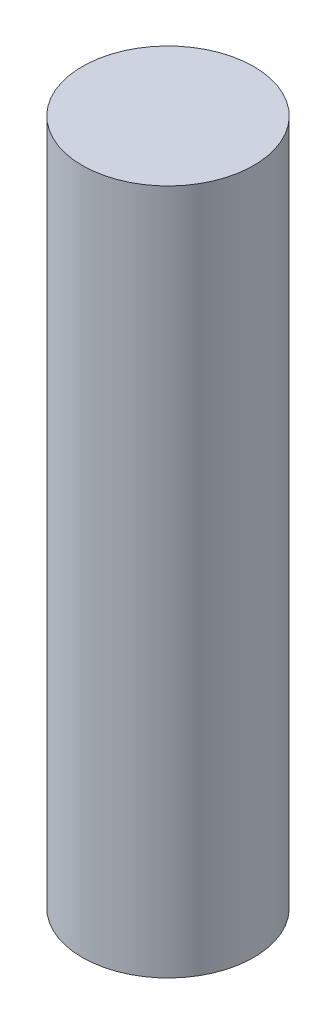
ISO-10303-21;
HEADER;
FILE_DESCRIPTION(('STEP AP214'),'2;1');
FILE_NAME('part.step','',(''),(''),'','','');
FILE_SCHEMA(('AUTOMOTIVE_DESIGN { 1 0 10303 214 1 1 1 1 }'));
ENDSEC;
DATA;
#1=APPLICATION_CONTEXT('core data for automotive mechanical design processes');
#2=APPLICATION_PROTOCOL_DEFINITION('international standard','automotive_design',2000,#1);
#3=PRODUCT_CONTEXT('',#1,'mechanical');
#4=PRODUCT('Part','Part','',(#3));
#5=PRODUCT_RELATED_PRODUCT_CATEGORY('part','',(#4));
#6=PRODUCT_DEFINITION_FORMATION('','',#4);
#7=PRODUCT_DEFINITION_CONTEXT('part definition',#1,'design');
#8=PRODUCT_DEFINITION('design','',#6,#7);
#9=PRODUCT_DEFINITION_SHAPE('','',#8);
#10=(LENGTH_UNIT() NAMED_UNIT(*) SI_UNIT(.MILLI.,.METRE.));
#11=(NAMED_UNIT(*) PLANE_ANGLE_UNIT() SI_UNIT($,.RADIAN.));
#12=(NAMED_UNIT(*) SI_UNIT($,.STERADIAN.) SOLID_ANGLE_UNIT());
#13=UNCERTAINTY_MEASURE_WITH_UNIT(LENGTH_MEASURE(1.E-05),#10,'distance_accuracy_value','');
#14=(GEOMETRIC_REPRESENTATION_CONTEXT(3) GLOBAL_UNCERTAINTY_ASSIGNED_CONTEXT((#13)) GLOBAL_UNIT_ASSIGNED_CONTEXT((#10,
#11,#12)) REPRESENTATION_CONTEXT('',''));
#15=CARTESIAN_POINT('',(0.,0.,0.));
#16=DIRECTION('',(0.,0.,1.));
#17=DIRECTION('',(1.,0.,0.));
#18=AXIS2_PLACEMENT_3D('',#15,#16,#17);
#19=CARTESIAN_POINT('',(0.,100.,0.));
#20=DIRECTION('',(0.,-1.,0.));
#21=DIRECTION('',(0.,0.,-1.));
#22=AXIS2_PLACEMENT_3D('',#19,#20,#21);
#23=CYLINDRICAL_SURFACE('',#22,25.);
#24=CARTESIAN_POINT('',(0.,100.,0.));
#25=DIRECTION('',(0.,1.,0.));
#26=DIRECTION('',(0.,0.,1.));
#27=AXIS2_PLACEMENT_3D('',#24,#25,#26);
#28=CIRCLE('',#27,25.);
#29=CARTESIAN_POINT('',(0.,100.,25.));
#30=VERTEX_POINT('',#29);
#31=EDGE_CURVE('E10',#30,#30,#28,.T.);
#32=ORIENTED_EDGE('',*,*,#31,.F.);
#33=EDGE_LOOP('',(#32));
#34=FACE_BOUND('',#33,.T.);
#35=CARTESIAN_POINT('',(0.,-100.,0.));
#36=DIRECTION('',(0.,1.,0.));
#37=DIRECTION('',(0.,0.,1.));
#38=AXIS2_PLACEMENT_3D('',#35,#36,#37);
#39=CIRCLE('',#38,25.);
#40=CARTESIAN_POINT('',(0.,-100.,25.));
#41=VERTEX_POINT('',#40);
#42=EDGE_CURVE('E34',#41,#41,#39,.T.);
#43=ORIENTED_EDGE('',*,*,#42,.T.);
#44=EDGE_LOOP('',(#43));
#45=FACE_BOUND('',#44,.T.);
#46=ADVANCED_FACE('F31',(#34,#45),#23,.T.);
#47=CARTESIAN_POINT('',(0.,100.,0.));
#48=DIRECTION('',(0.,1.,0.));
#49=DIRECTION('',(0.,0.,1.));
#50=AXIS2_PLACEMENT_3D('',#47,#48,#49);
#51=PLANE('',#50);
#52=ORIENTED_EDGE('',*,*,#31,.T.);
#53=EDGE_LOOP('',(#52));
#54=FACE_BOUND('',#53,.T.);
#55=ADVANCED_FACE('F46',(#54),#51,.T.);
#56=CARTESIAN_POINT('',(0.,-100.,0.));
#57=DIRECTION('',(0.,1.,0.));
#58=DIRECTION('',(0.,0.,1.));
#59=AXIS2_PLACEMENT_3D('',#56,#57,#58);
#60=PLANE('',#59);
#61=ORIENTED_EDGE('',*,*,#42,.F.);
#62=EDGE_LOOP('',(#61));
#63=FACE_BOUND('',#62,.T.);
#64=ADVANCED_FACE('F44',(#63),#60,.F.);
#65=CLOSED_SHELL('',(#46,#55,#64));
#66=MANIFOLD_SOLID_BREP('B2',#65);
#67=ADVANCED_BREP_SHAPE_REPRESENTATION('',(#18,#66),#14);
#68=SHAPE_DEFINITION_REPRESENTATION(#9,#67);
ENDSEC;
END-ISO-10303-21;
